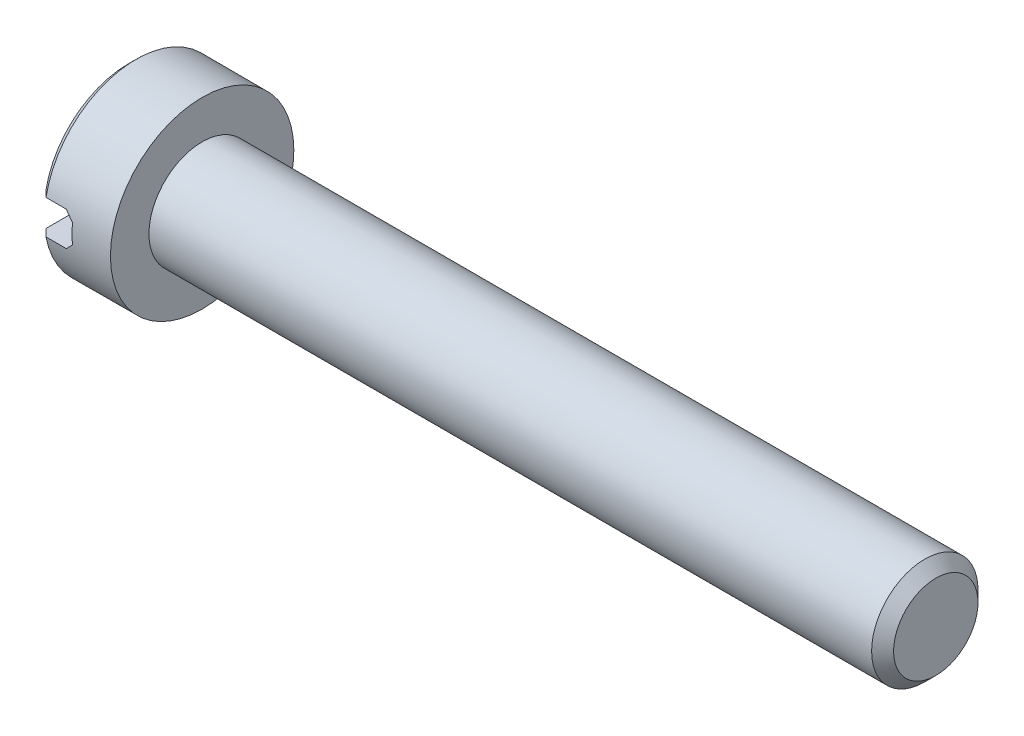
ISO-10303-21;
HEADER;
FILE_DESCRIPTION(('STEP AP214'),'2;1');
FILE_NAME('part.step','',(''),(''),'','','');
FILE_SCHEMA(('AUTOMOTIVE_DESIGN { 1 0 10303 214 1 1 1 1 }'));
ENDSEC;
DATA;
#1=APPLICATION_CONTEXT('core data for automotive mechanical design processes');
#2=APPLICATION_PROTOCOL_DEFINITION('international standard','automotive_design',2000,#1);
#3=PRODUCT_CONTEXT('',#1,'mechanical');
#4=PRODUCT('Part','Part','',(#3));
#5=PRODUCT_RELATED_PRODUCT_CATEGORY('part','',(#4));
#6=PRODUCT_DEFINITION_FORMATION('','',#4);
#7=PRODUCT_DEFINITION_CONTEXT('part definition',#1,'design');
#8=PRODUCT_DEFINITION('design','',#6,#7);
#9=PRODUCT_DEFINITION_SHAPE('','',#8);
#10=(LENGTH_UNIT() NAMED_UNIT(*) SI_UNIT(.MILLI.,.METRE.));
#11=(NAMED_UNIT(*) PLANE_ANGLE_UNIT() SI_UNIT($,.RADIAN.));
#12=(NAMED_UNIT(*) SI_UNIT($,.STERADIAN.) SOLID_ANGLE_UNIT());
#13=UNCERTAINTY_MEASURE_WITH_UNIT(LENGTH_MEASURE(1.E-05),#10,'distance_accuracy_value','');
#14=(GEOMETRIC_REPRESENTATION_CONTEXT(3) GLOBAL_UNCERTAINTY_ASSIGNED_CONTEXT((#13)) GLOBAL_UNIT_ASSIGNED_CONTEXT((#10,
#11,#12)) REPRESENTATION_CONTEXT('',''));
#15=CARTESIAN_POINT('',(0.,0.,0.));
#16=DIRECTION('',(0.,0.,1.));
#17=DIRECTION('',(1.,0.,0.));
#18=AXIS2_PLACEMENT_3D('',#15,#16,#17);
#19=CARTESIAN_POINT('',(2.,2.5,0.));
#20=DIRECTION('',(-1.,0.,0.));
#21=DIRECTION('',(0.,0.,1.));
#22=AXIS2_PLACEMENT_3D('',#19,#20,#21);
#23=PLANE('',#22);
#24=CARTESIAN_POINT('',(2.,0.,0.));
#25=DIRECTION('',(-1.,0.,0.));
#26=DIRECTION('',(0.,0.,1.));
#27=AXIS2_PLACEMENT_3D('',#24,#25,#26);
#28=CIRCLE('',#27,2.5);
#29=CARTESIAN_POINT('',(2.,0.,2.5));
#30=VERTEX_POINT('',#29);
#31=EDGE_CURVE('E191',#30,#30,#28,.T.);
#32=ORIENTED_EDGE('',*,*,#31,.F.);
#33=EDGE_LOOP('',(#32));
#34=FACE_BOUND('',#33,.T.);
#35=CARTESIAN_POINT('',(2.,0.,0.));
#36=DIRECTION('',(-1.,0.,0.));
#37=DIRECTION('',(0.,0.,1.));
#38=AXIS2_PLACEMENT_3D('',#35,#36,#37);
#39=CIRCLE('',#38,1.45);
#40=CARTESIAN_POINT('',(2.,0.,1.45));
#41=VERTEX_POINT('',#40);
#42=EDGE_CURVE('E140',#41,#41,#39,.F.);
#43=ORIENTED_EDGE('',*,*,#42,.F.);
#44=EDGE_LOOP('',(#43));
#45=FACE_BOUND('',#44,.T.);
#46=ADVANCED_FACE('F28',(#34,#45),#23,.F.);
#47=CARTESIAN_POINT('',(0.,0.,0.));
#48=DIRECTION('',(1.,0.,0.));
#49=DIRECTION('',(0.,0.,-1.));
#50=AXIS2_PLACEMENT_3D('',#47,#48,#49);
#51=PLANE('',#50);
#52=CARTESIAN_POINT('',(0.,0.,0.));
#53=DIRECTION('',(-1.,0.,0.));
#54=DIRECTION('',(0.,0.,1.));
#55=AXIS2_PLACEMENT_3D('',#52,#53,#54);
#56=CIRCLE('',#55,2.3);
#57=CARTESIAN_POINT('',(0.,0.465549348230913,2.25239068644003));
#58=VERTEX_POINT('',#57);
#59=CARTESIAN_POINT('',(0.,0.465549348230913,-2.25239068644003));
#60=VERTEX_POINT('',#59);
#61=EDGE_CURVE('E110',#58,#60,#56,.T.);
#62=ORIENTED_EDGE('',*,*,#61,.T.);
#63=DIRECTION('',(0.,0.,1.));
#64=VECTOR('',#63,1.);
#65=CARTESIAN_POINT('',(0.,0.465549348230913,-5.));
#66=LINE('',#65,#64);
#67=EDGE_CURVE('E103',#60,#58,#66,.T.);
#68=ORIENTED_EDGE('',*,*,#67,.T.);
#69=EDGE_LOOP('',(#62,#68));
#70=FACE_BOUND('',#69,.T.);
#71=ADVANCED_FACE('F158',(#70),#51,.F.);
#72=CARTESIAN_POINT('',(0.2,0.,0.));
#73=DIRECTION('',(1.,0.,0.));
#74=DIRECTION('',(0.,0.,-1.));
#75=AXIS2_PLACEMENT_3D('',#72,#73,#74);
#76=CONICAL_SURFACE('',#75,2.5,0.785398163397449);
#77=CARTESIAN_POINT('',(0.2,0.,0.));
#78=DIRECTION('',(-1.,0.,0.));
#79=DIRECTION('',(0.,0.,1.));
#80=AXIS2_PLACEMENT_3D('',#77,#78,#79);
#81=CIRCLE('',#80,2.5);
#82=CARTESIAN_POINT('',(0.2,0.465549348230913,2.45627030360296));
#83=VERTEX_POINT('',#82);
#84=CARTESIAN_POINT('',(0.2,0.465549348230913,-2.45627030360296));
#85=VERTEX_POINT('',#84);
#86=EDGE_CURVE('E111',#83,#85,#81,.T.);
#87=ORIENTED_EDGE('',*,*,#86,.T.);
#88=CARTESIAN_POINT('',(3.20259904076723,0.465549348230913,-5.48286968729098));
#89=CARTESIAN_POINT('',(3.00738145959935,0.465549348230913,-5.28694329289562));
#90=CARTESIAN_POINT('',(2.81219546067579,0.465549348230913,-5.09098538985915));
#91=CARTESIAN_POINT('',(2.42191937891038,0.465549348230913,-4.69895178557872));
#92=CARTESIAN_POINT('',(2.22682930219255,0.465549348230913,-4.50287607823863));
#93=CARTESIAN_POINT('',(1.83653240706012,0.465549348230913,-4.11030517611593));
#94=CARTESIAN_POINT('',(1.64132579611623,0.465549348230913,-3.9138097750014));
#95=CARTESIAN_POINT('',(1.25115924421648,0.465549348230913,-3.52059587027371));
#96=CARTESIAN_POINT('',(1.05619929014715,0.465549348230913,-3.32387737967476));
#97=CARTESIAN_POINT('',(0.678173026290478,0.465549348230913,-2.9416895419363));
#98=CARTESIAN_POINT('',(0.495084501131994,0.465549348230913,-2.7562421918476));
#99=CARTESIAN_POINT('',(0.220902938364085,0.465549348230913,-2.47759625217052));
#100=CARTESIAN_POINT('',(0.129576630819242,0.465549348230913,-2.38462728539378));
#101=CARTESIAN_POINT('',(-0.0528521527638664,0.465549348230913,-2.19847287291091));
#102=CARTESIAN_POINT('',(-0.143954632395984,0.465549348230913,-2.10528743072794));
#103=CARTESIAN_POINT('',(-0.325762187411694,0.465549348230913,-1.91867757427864));
#104=CARTESIAN_POINT('',(-0.416467526691369,0.465549348230913,-1.82525341749482));
#105=CARTESIAN_POINT('',(-0.597381873326261,0.465549348230913,-1.63791440165395));
#106=CARTESIAN_POINT('',(-0.687590849458516,0.465549348230913,-1.54399951243647));
#107=CARTESIAN_POINT('',(-0.867162247825724,0.465549348230913,-1.3554114454591));
#108=CARTESIAN_POINT('',(-0.956524909350582,0.465549348230913,-1.26073849690962));
#109=CARTESIAN_POINT('',(-1.08939468495382,0.465549348230913,-1.11764625640034));
#110=CARTESIAN_POINT('',(-1.1334867082123,0.465549348230913,-1.06977082072954));
#111=CARTESIAN_POINT('',(-1.2210969597667,0.465549348230913,-0.973498550024909));
#112=CARTESIAN_POINT('',(-1.26461520900373,0.465549348230913,-0.925101734137766));
#113=CARTESIAN_POINT('',(-1.3317610681347,0.465549348230913,-0.849065289158111));
#114=CARTESIAN_POINT('',(-1.35569012099074,0.465549348230913,-0.821692131835998));
#115=CARTESIAN_POINT('',(-1.40319102244514,0.465549348230913,-0.766632100193609));
#116=CARTESIAN_POINT('',(-1.42676283514449,0.465549348230913,-0.73894519482706));
#117=CARTESIAN_POINT('',(-1.47366376684455,0.465549348230913,-0.682886365346766));
#118=CARTESIAN_POINT('',(-1.49698800292058,0.465549348230913,-0.654510342179644));
#119=CARTESIAN_POINT('',(-1.54295549742156,0.465549348230913,-0.597221058712914));
#120=CARTESIAN_POINT('',(-1.56559892715386,0.465549348230913,-0.568307936573488));
#121=CARTESIAN_POINT('',(-1.61016736197608,0.465549348230913,-0.509419742712258));
#122=CARTESIAN_POINT('',(-1.63208156923063,0.465549348230913,-0.479436434264725));
#123=CARTESIAN_POINT('',(-1.67445976083722,0.465549348230913,-0.418389024408675));
#124=CARTESIAN_POINT('',(-1.69492180209863,0.465549348230913,-0.387323554832705));
#125=CARTESIAN_POINT('',(-1.73332185678116,0.465549348230913,-0.324061124181559));
#126=CARTESIAN_POINT('',(-1.75128287953761,0.465549348230913,-0.291878431816847));
#127=CARTESIAN_POINT('',(-1.78342369621955,0.465549348230913,-0.225717265309184));
#128=CARTESIAN_POINT('',(-1.79761500076547,0.465549348230913,-0.191744646392133));
#129=CARTESIAN_POINT('',(-1.81895609795713,0.465549348230913,-0.124795883091766));
#130=CARTESIAN_POINT('',(-1.8266128932659,0.465549348230913,-0.0919921322132611));
#131=CARTESIAN_POINT('',(-1.83488894775632,0.465549348230913,-0.0256267496241762));
#132=CARTESIAN_POINT('',(-1.83554895937427,0.465549348230913,0.00792935132869227));
#133=CARTESIAN_POINT('',(-1.82973306120756,0.465549348230913,0.0742464015597508));
#134=CARTESIAN_POINT('',(-1.82328333400206,0.465549348230913,0.107009817283791));
#135=CARTESIAN_POINT('',(-1.80956338762447,0.465549348230913,0.155027331571199));
#136=CARTESIAN_POINT('',(-1.80428518983903,0.465549348230913,0.170909212358321));
#137=CARTESIAN_POINT('',(-1.79261948745361,0.465549348230913,0.202260246274237));
#138=CARTESIAN_POINT('',(-1.78623214101843,0.465549348230913,0.217729457887391));
#139=CARTESIAN_POINT('',(-1.76761840023324,0.465549348230913,0.259328209218331));
#140=CARTESIAN_POINT('',(-1.7545143196465,0.465549348230913,0.285061417842786));
#141=CARTESIAN_POINT('',(-1.72651469614149,0.465549348230913,0.335544158020592));
#142=CARTESIAN_POINT('',(-1.71161720540743,0.465549348230913,0.360292580485516));
#143=CARTESIAN_POINT('',(-1.68054228203642,0.465549348230913,0.409079841714359));
#144=CARTESIAN_POINT('',(-1.66436078635795,0.465549348230913,0.433116068257987));
#145=CARTESIAN_POINT('',(-1.63111775750428,0.465549348230913,0.480575042863358));
#146=CARTESIAN_POINT('',(-1.61405601084805,0.465549348230913,0.503997640009445));
#147=CARTESIAN_POINT('',(-1.5616167270468,0.465549348230913,0.573971640763827));
#148=CARTESIAN_POINT('',(-1.52527399334495,0.465549348230913,0.619796593427046));
#149=CARTESIAN_POINT('',(-1.45124163289229,0.465549348230913,0.710149565111901));
#150=CARTESIAN_POINT('',(-1.41355526157427,0.465549348230913,0.7546802997551));
#151=CARTESIAN_POINT('',(-1.33810033893443,0.465549348230913,0.842013934301668));
#152=CARTESIAN_POINT('',(-1.30035092246978,0.465549348230913,0.884833404050981));
#153=CARTESIAN_POINT('',(-1.22427339982634,0.465549348230913,0.969954837541984));
#154=CARTESIAN_POINT('',(-1.18594527816913,0.465549348230913,1.01225678738678));
#155=CARTESIAN_POINT('',(-1.07035214447441,0.465549348230913,1.13862723555416));
#156=CARTESIAN_POINT('',(-0.992489260170284,0.465549348230913,1.22214795765609));
#157=CARTESIAN_POINT('',(-0.835814007667518,0.465549348230913,1.38847609582379));
#158=CARTESIAN_POINT('',(-0.757000620957103,0.465549348230913,1.47128254610905));
#159=CARTESIAN_POINT('',(-0.598849232799755,0.465549348230913,1.63637982121664));
#160=CARTESIAN_POINT('',(-0.519511274422271,0.465549348230913,1.71867068731607));
#161=CARTESIAN_POINT('',(-0.361217712976167,0.465549348230913,1.88216701603883));
#162=CARTESIAN_POINT('',(-0.282265248575711,0.465549348230913,1.9633755225318));
#163=CARTESIAN_POINT('',(-0.124123333736655,0.465549348230913,2.12556467511988));
#164=CARTESIAN_POINT('',(-0.044933878372658,0.465549348230913,2.20654531641042));
#165=CARTESIAN_POINT('',(0.192811054539122,0.465549348230913,2.44916767308598));
#166=CARTESIAN_POINT('',(0.351615992082501,0.465549348230913,2.61056482504039));
#167=CARTESIAN_POINT('',(0.732972757071635,0.465549348230913,2.99726131212903));
#168=CARTESIAN_POINT('',(0.955700706319338,0.465549348230913,3.22238674752163));
#169=CARTESIAN_POINT('',(1.401572977937,0.465549348230913,3.67230050679293));
#170=CARTESIAN_POINT('',(1.62471736464727,0.465549348230913,3.89708876686418));
#171=CARTESIAN_POINT('',(2.07358635321307,0.465549348230913,4.34881324556589));
#172=CARTESIAN_POINT('',(2.29931333445495,0.465549348230913,4.57574709913376));
#173=CARTESIAN_POINT('',(2.7508805263624,0.465549348230913,5.02942321622607));
#174=CARTESIAN_POINT('',(2.97672071035442,0.465549348230913,5.2561655062971));
#175=CARTESIAN_POINT('',(3.20259904076724,0.465549348230913,5.48286968729098));
#176=B_SPLINE_CURVE_WITH_KNOTS('',3,(#88,#89,#90,#91,#92,#93,#94,#95,#96,#97,#98,#99,#100,#101,
#102,#103,#104,#105,#106,#107,#108,#109,#110,#111,#112,#113,#114,#115,#116,#117,#118,#119,#120,
#121,#122,#123,#124,#125,#126,#127,#128,#129,#130,#131,#132,#133,#134,#135,#136,#137,#138,#139,
#140,#141,#142,#143,#144,#145,#146,#147,#148,#149,#150,#151,#152,#153,#154,#155,#156,#157,#158,
#159,#160,#161,#162,#163,#164,#165,#166,#167,#168,#169,#170,#171,#172,#173,#174,#175),
.UNSPECIFIED.,.F.,.F.,(4,2,2,2,2,2,2,2,2,2,2,2,2,2,2,2,2,2,2,2,2,2,2,2,2,2,2,2,2,2,2,2,2,2,2,2,
2,2,2,2,2,2,2,4),(0.,0.829743073340608,1.65953360095567,2.49046340540357,3.3213470024816,
4.10314469139847,4.49410926633512,4.88506752224857,5.27570632324448,5.66636942212084,
6.05691855181897,6.25217337755999,6.44742105722462,6.55649218217525,6.66557419594665,
6.77576205404667,6.88592195014922,6.99730763492697,7.10883965543405,7.21926609048524,
7.32935136450646,7.42981570469559,7.52969457133972,7.62920684560584,7.67938417859199,
7.72955436214783,7.81607261219315,7.90268569183183,7.9895847021618,8.07650488747965,
8.25190336684877,8.42690244879081,8.59814445390702,8.76939104731505,9.11193368974146,
9.45488345933612,9.79780541262763,10.1375912828317,10.4773842645597,11.1566564623285,
12.1067097788694,13.0569245869456,14.0171665517813,14.9772407465216),.UNSPECIFIED.);
#177=EDGE_CURVE('E51',#85,#60,#176,.T.);
#178=ORIENTED_EDGE('',*,*,#177,.T.);
#179=ORIENTED_EDGE('',*,*,#61,.F.);
#180=EDGE_CURVE('E185',#58,#83,#176,.T.);
#181=ORIENTED_EDGE('',*,*,#180,.T.);
#182=EDGE_LOOP('',(#87,#178,#179,#181));
#183=FACE_BOUND('',#182,.T.);
#184=ADVANCED_FACE('F166',(#183),#76,.T.);
#185=CARTESIAN_POINT('',(0.,-0.465549348230913,-2.25239068644003));
#186=VERTEX_POINT('',#185);
#187=CARTESIAN_POINT('',(0.,-0.465549348230913,2.25239068644003));
#188=VERTEX_POINT('',#187);
#189=EDGE_CURVE('E107',#186,#188,#56,.T.);
#190=ORIENTED_EDGE('',*,*,#189,.T.);
#191=DIRECTION('',(0.,0.,1.));
#192=VECTOR('',#191,1.);
#193=CARTESIAN_POINT('',(0.,-0.465549348230913,-5.));
#194=LINE('',#193,#192);
#195=EDGE_CURVE('E94',#186,#188,#194,.T.);
#196=ORIENTED_EDGE('',*,*,#195,.F.);
#197=EDGE_LOOP('',(#190,#196));
#198=FACE_BOUND('',#197,.T.);
#199=ADVANCED_FACE('F30',(#198),#51,.F.);
#200=CARTESIAN_POINT('',(0.2,-0.465549348230913,-2.45627030360296));
#201=VERTEX_POINT('',#200);
#202=CARTESIAN_POINT('',(0.2,-0.465549348230913,2.45627030360296));
#203=VERTEX_POINT('',#202);
#204=EDGE_CURVE('E115',#201,#203,#81,.T.);
#205=ORIENTED_EDGE('',*,*,#204,.T.);
#206=CARTESIAN_POINT('',(3.20259904076724,-0.465549348230913,5.48286968729098));
#207=CARTESIAN_POINT('',(3.00738145959935,-0.465549348230913,5.28694329289562));
#208=CARTESIAN_POINT('',(2.81219546067579,-0.465549348230913,5.09098538985916));
#209=CARTESIAN_POINT('',(2.42191937891038,-0.465549348230913,4.69895178557872));
#210=CARTESIAN_POINT('',(2.22682930219255,-0.465549348230913,4.50287607823863));
#211=CARTESIAN_POINT('',(1.83653240706012,-0.465549348230913,4.11030517611593));
#212=CARTESIAN_POINT('',(1.64132579611623,-0.465549348230913,3.9138097750014));
#213=CARTESIAN_POINT('',(1.25115924421648,-0.465549348230913,3.52059587027371));
#214=CARTESIAN_POINT('',(1.05619929014715,-0.465549348230913,3.32387737967475));
#215=CARTESIAN_POINT('',(0.678173026290476,-0.465549348230913,2.9416895419363));
#216=CARTESIAN_POINT('',(0.495084501131992,-0.465549348230913,2.75624219184759));
#217=CARTESIAN_POINT('',(0.220902938364083,-0.465549348230913,2.47759625217052));
#218=CARTESIAN_POINT('',(0.12957663081924,-0.465549348230913,2.38462728539378));
#219=CARTESIAN_POINT('',(-0.0528521527638681,-0.465549348230913,2.19847287291091));
#220=CARTESIAN_POINT('',(-0.143954632395986,-0.465549348230913,2.10528743072794));
#221=CARTESIAN_POINT('',(-0.325762187411696,-0.465549348230913,1.91867757427864));
#222=CARTESIAN_POINT('',(-0.41646752669137,-0.465549348230913,1.82525341749482));
#223=CARTESIAN_POINT('',(-0.597381873326262,-0.465549348230913,1.63791440165395));
#224=CARTESIAN_POINT('',(-0.687590849458517,-0.465549348230913,1.54399951243647));
#225=CARTESIAN_POINT('',(-0.867162247825725,-0.465549348230913,1.3554114454591));
#226=CARTESIAN_POINT('',(-0.956524909350583,-0.465549348230913,1.26073849690962));
#227=CARTESIAN_POINT('',(-1.08939468495382,-0.465549348230913,1.11764625640034));
#228=CARTESIAN_POINT('',(-1.1334867082123,-0.465549348230913,1.06977082072953));
#229=CARTESIAN_POINT('',(-1.2210969597667,-0.465549348230913,0.973498550024909));
#230=CARTESIAN_POINT('',(-1.26461520900373,-0.465549348230913,0.925101734137766));
#231=CARTESIAN_POINT('',(-1.33176106813471,-0.465549348230913,0.84906528915811));
#232=CARTESIAN_POINT('',(-1.35569012099074,-0.465549348230913,0.821692131835997));
#233=CARTESIAN_POINT('',(-1.40319102244514,-0.465549348230913,0.766632100193609));
#234=CARTESIAN_POINT('',(-1.42676283514449,-0.465549348230913,0.738945194827059));
#235=CARTESIAN_POINT('',(-1.47366376684455,-0.465549348230913,0.682886365346765));
#236=CARTESIAN_POINT('',(-1.49698800292058,-0.465549348230913,0.654510342179643));
#237=CARTESIAN_POINT('',(-1.54295549742156,-0.465549348230913,0.597221058712913));
#238=CARTESIAN_POINT('',(-1.56559892715386,-0.465549348230913,0.568307936573487));
#239=CARTESIAN_POINT('',(-1.61016736197608,-0.465549348230913,0.509419742712257));
#240=CARTESIAN_POINT('',(-1.63208156923063,-0.465549348230913,0.479436434264725));
#241=CARTESIAN_POINT('',(-1.67445976083722,-0.465549348230913,0.418389024408674));
#242=CARTESIAN_POINT('',(-1.69492180209863,-0.465549348230913,0.387323554832704));
#243=CARTESIAN_POINT('',(-1.73332185678116,-0.465549348230913,0.324061124181558));
#244=CARTESIAN_POINT('',(-1.75128287953761,-0.465549348230913,0.291878431816847));
#245=CARTESIAN_POINT('',(-1.78342369621955,-0.465549348230913,0.225717265309183));
#246=CARTESIAN_POINT('',(-1.79761500076547,-0.465549348230913,0.191744646392132));
#247=CARTESIAN_POINT('',(-1.81895609795713,-0.465549348230913,0.124795883091765));
#248=CARTESIAN_POINT('',(-1.8266128932659,-0.465549348230913,0.0919921322132606));
#249=CARTESIAN_POINT('',(-1.83488894775632,-0.465549348230913,0.0256267496241758));
#250=CARTESIAN_POINT('',(-1.83554895937427,-0.465549348230913,-0.00792935132869264));
#251=CARTESIAN_POINT('',(-1.82973306120756,-0.465549348230913,-0.0742464015597512));
#252=CARTESIAN_POINT('',(-1.82328333400206,-0.465549348230913,-0.107009817283792));
#253=CARTESIAN_POINT('',(-1.80956338762447,-0.465549348230913,-0.155027331571199));
#254=CARTESIAN_POINT('',(-1.80428518983903,-0.465549348230913,-0.170909212358322));
#255=CARTESIAN_POINT('',(-1.79261948745361,-0.465549348230913,-0.202260246274238));
#256=CARTESIAN_POINT('',(-1.78623214101843,-0.465549348230913,-0.217729457887391));
#257=CARTESIAN_POINT('',(-1.76761840023324,-0.465549348230913,-0.259328209218332));
#258=CARTESIAN_POINT('',(-1.7545143196465,-0.465549348230913,-0.285061417842787));
#259=CARTESIAN_POINT('',(-1.72651469614149,-0.465549348230913,-0.335544158020594));
#260=CARTESIAN_POINT('',(-1.71161720540743,-0.465549348230913,-0.360292580485518));
#261=CARTESIAN_POINT('',(-1.68054228203642,-0.465549348230913,-0.40907984171436));
#262=CARTESIAN_POINT('',(-1.66436078635794,-0.465549348230913,-0.433116068257989));
#263=CARTESIAN_POINT('',(-1.63111775750427,-0.465549348230913,-0.48057504286336));
#264=CARTESIAN_POINT('',(-1.61405601084805,-0.465549348230913,-0.503997640009447));
#265=CARTESIAN_POINT('',(-1.5616167270468,-0.465549348230913,-0.573971640763828));
#266=CARTESIAN_POINT('',(-1.52527399334495,-0.465549348230913,-0.619796593427047));
#267=CARTESIAN_POINT('',(-1.45124163289228,-0.465549348230913,-0.710149565111902));
#268=CARTESIAN_POINT('',(-1.41355526157427,-0.465549348230913,-0.754680299755101));
#269=CARTESIAN_POINT('',(-1.33810033893443,-0.465549348230913,-0.842013934301668));
#270=CARTESIAN_POINT('',(-1.30035092246978,-0.465549348230913,-0.88483340405098));
#271=CARTESIAN_POINT('',(-1.22427339982634,-0.465549348230913,-0.969954837541984));
#272=CARTESIAN_POINT('',(-1.18594527816912,-0.465549348230913,-1.01225678738678));
#273=CARTESIAN_POINT('',(-1.07035214447441,-0.465549348230913,-1.13862723555416));
#274=CARTESIAN_POINT('',(-0.992489260170283,-0.465549348230913,-1.2221479576561));
#275=CARTESIAN_POINT('',(-0.835814007667517,-0.465549348230913,-1.38847609582379));
#276=CARTESIAN_POINT('',(-0.757000620957102,-0.465549348230913,-1.47128254610905));
#277=CARTESIAN_POINT('',(-0.598849232799754,-0.465549348230913,-1.63637982121664));
#278=CARTESIAN_POINT('',(-0.51951127442227,-0.465549348230913,-1.71867068731607));
#279=CARTESIAN_POINT('',(-0.361217712976166,-0.465549348230913,-1.88216701603883));
#280=CARTESIAN_POINT('',(-0.282265248575709,-0.465549348230913,-1.9633755225318));
#281=CARTESIAN_POINT('',(-0.124123333736654,-0.465549348230913,-2.12556467511988));
#282=CARTESIAN_POINT('',(-0.0449338783726567,-0.465549348230913,-2.20654531641042));
#283=CARTESIAN_POINT('',(0.192811054539124,-0.465549348230913,-2.44916767308598));
#284=CARTESIAN_POINT('',(0.351615992082503,-0.465549348230913,-2.6105648250404));
#285=CARTESIAN_POINT('',(0.732972757071637,-0.465549348230913,-2.99726131212903));
#286=CARTESIAN_POINT('',(0.95570070631934,-0.465549348230913,-3.22238674752163));
#287=CARTESIAN_POINT('',(1.401572977937,-0.465549348230913,-3.67230050679293));
#288=CARTESIAN_POINT('',(1.62471736464727,-0.465549348230913,-3.89708876686418));
#289=CARTESIAN_POINT('',(2.07358635321307,-0.465549348230913,-4.34881324556589));
#290=CARTESIAN_POINT('',(2.29931333445495,-0.465549348230913,-4.57574709913376));
#291=CARTESIAN_POINT('',(2.75088052636241,-0.465549348230913,-5.02942321622608));
#292=CARTESIAN_POINT('',(2.97672071035443,-0.465549348230913,-5.2561655062971));
#293=CARTESIAN_POINT('',(3.20259904076724,-0.465549348230913,-5.48286968729098));
#294=B_SPLINE_CURVE_WITH_KNOTS('',3,(#206,#207,#208,#209,#210,#211,#212,#213,#214,#215,#216,
#217,#218,#219,#220,#221,#222,#223,#224,#225,#226,#227,#228,#229,#230,#231,#232,#233,#234,#235,
#236,#237,#238,#239,#240,#241,#242,#243,#244,#245,#246,#247,#248,#249,#250,#251,#252,#253,#254,
#255,#256,#257,#258,#259,#260,#261,#262,#263,#264,#265,#266,#267,#268,#269,#270,#271,#272,#273,
#274,#275,#276,#277,#278,#279,#280,#281,#282,#283,#284,#285,#286,#287,#288,#289,#290,#291,#292,
#293),.UNSPECIFIED.,.F.,.F.,(4,2,2,2,2,2,2,2,2,2,2,2,2,2,2,2,2,2,2,2,2,2,2,2,2,2,2,2,2,2,2,2,2,
2,2,2,2,2,2,2,2,2,2,4),(0.,0.82974307334061,1.65953360095567,2.49046340540358,3.32134700248161,
4.10314469139847,4.49410926633512,4.88506752224858,5.27570632324449,5.66636942212084,
6.05691855181898,6.25217337756,6.44742105722463,6.55649218217526,6.66557419594665,
6.77576205404667,6.88592195014922,6.99730763492697,7.10883965543406,7.21926609048525,
7.32935136450647,7.42981570469559,7.52969457133973,7.62920684560584,7.67938417859199,
7.72955436214784,7.81607261219315,7.90268569183183,7.98958470216181,8.07650488747966,
8.25190336684877,8.42690244879082,8.59814445390702,8.76939104731506,9.11193368974146,
9.45488345933612,9.79780541262763,10.1375912828317,10.4773842645597,11.1566564623285,
12.1067097788694,13.0569245869456,14.0171665517813,14.9772407465216),.UNSPECIFIED.);
#295=EDGE_CURVE('E102',#203,#188,#294,.T.);
#296=ORIENTED_EDGE('',*,*,#295,.T.);
#297=ORIENTED_EDGE('',*,*,#189,.F.);
#298=EDGE_CURVE('E91',#186,#201,#294,.T.);
#299=ORIENTED_EDGE('',*,*,#298,.T.);
#300=EDGE_LOOP('',(#205,#296,#297,#299));
#301=FACE_BOUND('',#300,.T.);
#302=ADVANCED_FACE('F109',(#301),#76,.T.);
#303=CARTESIAN_POINT('',(0.,0.,0.));
#304=DIRECTION('',(-1.,0.,0.));
#305=DIRECTION('',(0.,0.,1.));
#306=AXIS2_PLACEMENT_3D('',#303,#304,#305);
#307=CYLINDRICAL_SURFACE('',#306,2.5);
#308=ORIENTED_EDGE('',*,*,#86,.F.);
#309=DIRECTION('',(-1.,0.,0.));
#310=VECTOR('',#309,1.);
#311=CARTESIAN_POINT('',(0.,0.465549348230913,2.45627030360296));
#312=LINE('',#311,#310);
#313=CARTESIAN_POINT('',(0.753445065176908,0.465549348230913,2.45627030360296));
#314=VERTEX_POINT('',#313);
#315=EDGE_CURVE('E137',#83,#314,#312,.F.);
#316=ORIENTED_EDGE('',*,*,#315,.T.);
#317=CARTESIAN_POINT('',(1.21899441340782,0.,0.));
#318=DIRECTION('',(0.707106781186548,0.707106781186548,0.));
#319=DIRECTION('',(-0.707106781186548,0.707106781186548,0.));
#320=AXIS2_PLACEMENT_3D('',#317,#318,#319);
#321=ELLIPSE('',#320,3.53553390593274,2.5);
#322=CARTESIAN_POINT('',(0.953445065176908,0.265549348230913,2.48585670215605));
#323=VERTEX_POINT('',#322);
#324=EDGE_CURVE('E132',#314,#323,#321,.T.);
#325=ORIENTED_EDGE('',*,*,#324,.T.);
#326=CARTESIAN_POINT('',(0.953445065176908,0.,0.));
#327=DIRECTION('',(1.,0.,0.));
#328=DIRECTION('',(0.,0.,-1.));
#329=AXIS2_PLACEMENT_3D('',#326,#327,#328);
#330=CIRCLE('',#329,2.5);
#331=CARTESIAN_POINT('',(0.953445065176908,-0.265549348230913,2.48585670215605));
#332=VERTEX_POINT('',#331);
#333=EDGE_CURVE('E128',#323,#332,#330,.T.);
#334=ORIENTED_EDGE('',*,*,#333,.T.);
#335=CARTESIAN_POINT('',(1.21899441340782,0.,0.));
#336=DIRECTION('',(0.707106781186548,-0.707106781186548,0.));
#337=DIRECTION('',(-0.707106781186548,-0.707106781186548,0.));
#338=AXIS2_PLACEMENT_3D('',#335,#336,#337);
#339=ELLIPSE('',#338,3.53553390593274,2.5);
#340=CARTESIAN_POINT('',(0.753445065176908,-0.465549348230913,2.45627030360296));
#341=VERTEX_POINT('',#340);
#342=EDGE_CURVE('E124',#332,#341,#339,.T.);
#343=ORIENTED_EDGE('',*,*,#342,.T.);
#344=DIRECTION('',(-1.,0.,0.));
#345=VECTOR('',#344,1.);
#346=CARTESIAN_POINT('',(0.,-0.465549348230913,2.45627030360296));
#347=LINE('',#346,#345);
#348=EDGE_CURVE('E134',#341,#203,#347,.T.);
#349=ORIENTED_EDGE('',*,*,#348,.T.);
#350=ORIENTED_EDGE('',*,*,#204,.F.);
#351=DIRECTION('',(-1.,0.,0.));
#352=VECTOR('',#351,1.);
#353=CARTESIAN_POINT('',(0.,-0.465549348230913,-2.45627030360296));
#354=LINE('',#353,#352);
#355=CARTESIAN_POINT('',(0.753445065176908,-0.465549348230913,-2.45627030360296));
#356=VERTEX_POINT('',#355);
#357=EDGE_CURVE('E97',#201,#356,#354,.F.);
#358=ORIENTED_EDGE('',*,*,#357,.T.);
#359=CARTESIAN_POINT('',(0.953445065176908,-0.265549348230913,-2.48585670215605));
#360=VERTEX_POINT('',#359);
#361=EDGE_CURVE('E120',#356,#360,#339,.T.);
#362=ORIENTED_EDGE('',*,*,#361,.T.);
#363=CARTESIAN_POINT('',(0.953445065176908,0.265549348230913,-2.48585670215605));
#364=VERTEX_POINT('',#363);
#365=EDGE_CURVE('E123',#360,#364,#330,.T.);
#366=ORIENTED_EDGE('',*,*,#365,.T.);
#367=CARTESIAN_POINT('',(0.753445065176908,0.465549348230913,-2.45627030360296));
#368=VERTEX_POINT('',#367);
#369=EDGE_CURVE('E127',#364,#368,#321,.T.);
#370=ORIENTED_EDGE('',*,*,#369,.T.);
#371=DIRECTION('',(-1.,0.,0.));
#372=VECTOR('',#371,1.);
#373=CARTESIAN_POINT('',(0.,0.465549348230913,-2.45627030360296));
#374=LINE('',#373,#372);
#375=EDGE_CURVE('E131',#368,#85,#374,.T.);
#376=ORIENTED_EDGE('',*,*,#375,.T.);
#377=EDGE_LOOP('',(#308,#316,#325,#334,#343,#349,#350,#358,#362,#366,#370,#376));
#378=FACE_BOUND('',#377,.T.);
#379=ORIENTED_EDGE('',*,*,#31,.T.);
#380=EDGE_LOOP('',(#379));
#381=FACE_BOUND('',#380,.T.);
#382=ADVANCED_FACE('F174',(#378,#381),#307,.T.);
#383=CARTESIAN_POINT('',(0.,0.465549348230913,-5.));
#384=DIRECTION('',(0.,1.,0.));
#385=DIRECTION('',(0.,0.,1.));
#386=AXIS2_PLACEMENT_3D('',#383,#384,#385);
#387=PLANE('',#386);
#388=ORIENTED_EDGE('',*,*,#375,.F.);
#389=DIRECTION('',(0.,0.,1.));
#390=VECTOR('',#389,1.);
#391=CARTESIAN_POINT('',(0.753445065176908,0.465549348230913,-5.));
#392=LINE('',#391,#390);
#393=EDGE_CURVE('E220',#368,#314,#392,.T.);
#394=ORIENTED_EDGE('',*,*,#393,.T.);
#395=ORIENTED_EDGE('',*,*,#315,.F.);
#396=ORIENTED_EDGE('',*,*,#180,.F.);
#397=ORIENTED_EDGE('',*,*,#67,.F.);
#398=ORIENTED_EDGE('',*,*,#177,.F.);
#399=EDGE_LOOP('',(#388,#394,#395,#396,#397,#398));
#400=FACE_BOUND('',#399,.T.);
#401=ADVANCED_FACE('F176',(#400),#387,.F.);
#402=CARTESIAN_POINT('',(0.753445065176908,0.465549348230913,-5.));
#403=DIRECTION('',(0.707106781186548,0.707106781186548,0.));
#404=DIRECTION('',(-0.707106781186548,0.707106781186548,0.));
#405=AXIS2_PLACEMENT_3D('',#402,#403,#404);
#406=PLANE('',#405);
#407=ORIENTED_EDGE('',*,*,#393,.F.);
#408=ORIENTED_EDGE('',*,*,#369,.F.);
#409=DIRECTION('',(0.,0.,1.));
#410=VECTOR('',#409,1.);
#411=CARTESIAN_POINT('',(0.953445065176908,0.265549348230913,-5.));
#412=LINE('',#411,#410);
#413=EDGE_CURVE('E222',#364,#323,#412,.T.);
#414=ORIENTED_EDGE('',*,*,#413,.T.);
#415=ORIENTED_EDGE('',*,*,#324,.F.);
#416=EDGE_LOOP('',(#407,#408,#414,#415));
#417=FACE_BOUND('',#416,.T.);
#418=ADVANCED_FACE('F196',(#417),#406,.F.);
#419=CARTESIAN_POINT('',(0.953445065176908,0.265549348230913,-5.));
#420=DIRECTION('',(1.,0.,0.));
#421=DIRECTION('',(0.,0.,-1.));
#422=AXIS2_PLACEMENT_3D('',#419,#420,#421);
#423=PLANE('',#422);
#424=ORIENTED_EDGE('',*,*,#413,.F.);
#425=ORIENTED_EDGE('',*,*,#365,.F.);
#426=DIRECTION('',(0.,0.,1.));
#427=VECTOR('',#426,1.);
#428=CARTESIAN_POINT('',(0.953445065176908,-0.265549348230913,-5.));
#429=LINE('',#428,#427);
#430=EDGE_CURVE('E211',#360,#332,#429,.T.);
#431=ORIENTED_EDGE('',*,*,#430,.T.);
#432=ORIENTED_EDGE('',*,*,#333,.F.);
#433=EDGE_LOOP('',(#424,#425,#431,#432));
#434=FACE_BOUND('',#433,.T.);
#435=ADVANCED_FACE('F199',(#434),#423,.F.);
#436=CARTESIAN_POINT('',(0.753445065176908,-0.465549348230913,-5.));
#437=DIRECTION('',(0.707106781186548,-0.707106781186548,0.));
#438=DIRECTION('',(0.707106781186548,0.707106781186548,0.));
#439=AXIS2_PLACEMENT_3D('',#436,#437,#438);
#440=PLANE('',#439);
#441=DIRECTION('',(0.,0.,1.));
#442=VECTOR('',#441,1.);
#443=CARTESIAN_POINT('',(0.753445065176908,-0.465549348230913,-5.));
#444=LINE('',#443,#442);
#445=EDGE_CURVE('E43',#356,#341,#444,.T.);
#446=ORIENTED_EDGE('',*,*,#445,.T.);
#447=ORIENTED_EDGE('',*,*,#342,.F.);
#448=ORIENTED_EDGE('',*,*,#430,.F.);
#449=ORIENTED_EDGE('',*,*,#361,.F.);
#450=EDGE_LOOP('',(#446,#447,#448,#449));
#451=FACE_BOUND('',#450,.T.);
#452=ADVANCED_FACE('F202',(#451),#440,.F.);
#453=CARTESIAN_POINT('',(0.,-0.465549348230913,-5.));
#454=DIRECTION('',(0.,-1.,0.));
#455=DIRECTION('',(0.,0.,-1.));
#456=AXIS2_PLACEMENT_3D('',#453,#454,#455);
#457=PLANE('',#456);
#458=ORIENTED_EDGE('',*,*,#348,.F.);
#459=ORIENTED_EDGE('',*,*,#445,.F.);
#460=ORIENTED_EDGE('',*,*,#357,.F.);
#461=ORIENTED_EDGE('',*,*,#298,.F.);
#462=ORIENTED_EDGE('',*,*,#195,.T.);
#463=ORIENTED_EDGE('',*,*,#295,.F.);
#464=EDGE_LOOP('',(#458,#459,#460,#461,#462,#463));
#465=FACE_BOUND('',#464,.T.);
#466=ADVANCED_FACE('F93',(#465),#457,.F.);
#467=CARTESIAN_POINT('',(22.,0.,0.));
#468=DIRECTION('',(-1.,0.,0.));
#469=DIRECTION('',(0.,0.,1.));
#470=AXIS2_PLACEMENT_3D('',#467,#468,#469);
#471=CYLINDRICAL_SURFACE('',#470,1.45);
#472=CARTESIAN_POINT('',(21.7,0.,0.));
#473=DIRECTION('',(1.,0.,0.));
#474=DIRECTION('',(0.,0.,-1.));
#475=AXIS2_PLACEMENT_3D('',#472,#473,#474);
#476=CIRCLE('',#475,1.45);
#477=CARTESIAN_POINT('',(21.7,0.,-1.45));
#478=VERTEX_POINT('',#477);
#479=EDGE_CURVE('E11',#478,#478,#476,.F.);
#480=ORIENTED_EDGE('',*,*,#479,.T.);
#481=EDGE_LOOP('',(#480));
#482=FACE_BOUND('',#481,.T.);
#483=ORIENTED_EDGE('',*,*,#42,.T.);
#484=EDGE_LOOP('',(#483));
#485=FACE_BOUND('',#484,.T.);
#486=ADVANCED_FACE('F154',(#482,#485),#471,.T.);
#487=CARTESIAN_POINT('',(22.,0.,0.));
#488=DIRECTION('',(1.,0.,0.));
#489=DIRECTION('',(0.,0.,-1.));
#490=AXIS2_PLACEMENT_3D('',#487,#488,#489);
#491=PLANE('',#490);
#492=CARTESIAN_POINT('',(22.,0.,0.));
#493=DIRECTION('',(1.,0.,0.));
#494=DIRECTION('',(0.,0.,-1.));
#495=AXIS2_PLACEMENT_3D('',#492,#493,#494);
#496=CIRCLE('',#495,1.15);
#497=CARTESIAN_POINT('',(22.,0.,-1.15));
#498=VERTEX_POINT('',#497);
#499=EDGE_CURVE('E36',#498,#498,#496,.T.);
#500=ORIENTED_EDGE('',*,*,#499,.T.);
#501=EDGE_LOOP('',(#500));
#502=FACE_BOUND('',#501,.T.);
#503=ADVANCED_FACE('F145',(#502),#491,.T.);
#504=CARTESIAN_POINT('',(22.,0.,0.));
#505=DIRECTION('',(-1.,0.,0.));
#506=DIRECTION('',(0.,0.,1.));
#507=AXIS2_PLACEMENT_3D('',#504,#505,#506);
#508=CONICAL_SURFACE('',#507,1.15,0.785398163397454);
#509=ORIENTED_EDGE('',*,*,#479,.F.);
#510=EDGE_LOOP('',(#509));
#511=FACE_BOUND('',#510,.T.);
#512=ORIENTED_EDGE('',*,*,#499,.F.);
#513=EDGE_LOOP('',(#512));
#514=FACE_BOUND('',#513,.T.);
#515=ADVANCED_FACE('F147',(#511,#514),#508,.T.);
#516=CLOSED_SHELL('',(#46,#71,#184,#199,#302,#382,#401,#418,#435,#452,#466,#486,#503,#515));
#517=MANIFOLD_SOLID_BREP('B2',#516);
#518=ADVANCED_BREP_SHAPE_REPRESENTATION('',(#18,#517),#14);
#519=SHAPE_DEFINITION_REPRESENTATION(#9,#518);
ENDSEC;
END-ISO-10303-21;
